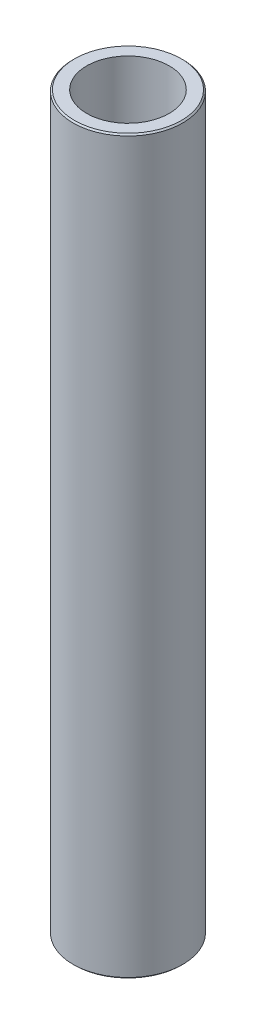
ISO-10303-21;
HEADER;
FILE_DESCRIPTION(('STEP AP214'),'2;1');
FILE_NAME('part.step','',(''),(''),'','','');
FILE_SCHEMA(('AUTOMOTIVE_DESIGN { 1 0 10303 214 1 1 1 1 }'));
ENDSEC;
DATA;
#1=APPLICATION_CONTEXT('core data for automotive mechanical design processes');
#2=APPLICATION_PROTOCOL_DEFINITION('international standard','automotive_design',2000,#1);
#3=PRODUCT_CONTEXT('',#1,'mechanical');
#4=PRODUCT('Part','Part','',(#3));
#5=PRODUCT_RELATED_PRODUCT_CATEGORY('part','',(#4));
#6=PRODUCT_DEFINITION_FORMATION('','',#4);
#7=PRODUCT_DEFINITION_CONTEXT('part definition',#1,'design');
#8=PRODUCT_DEFINITION('design','',#6,#7);
#9=PRODUCT_DEFINITION_SHAPE('','',#8);
#10=(LENGTH_UNIT() NAMED_UNIT(*) SI_UNIT(.MILLI.,.METRE.));
#11=(NAMED_UNIT(*) PLANE_ANGLE_UNIT() SI_UNIT($,.RADIAN.));
#12=(NAMED_UNIT(*) SI_UNIT($,.STERADIAN.) SOLID_ANGLE_UNIT());
#13=UNCERTAINTY_MEASURE_WITH_UNIT(LENGTH_MEASURE(1.E-05),#10,'distance_accuracy_value','');
#14=(GEOMETRIC_REPRESENTATION_CONTEXT(3) GLOBAL_UNCERTAINTY_ASSIGNED_CONTEXT((#13)) GLOBAL_UNIT_ASSIGNED_CONTEXT((#10,
#11,#12)) REPRESENTATION_CONTEXT('',''));
#15=CARTESIAN_POINT('',(0.,0.,0.));
#16=DIRECTION('',(0.,0.,1.));
#17=DIRECTION('',(1.,0.,0.));
#18=AXIS2_PLACEMENT_3D('',#15,#16,#17);
#19=CARTESIAN_POINT('',(0.,600.,0.));
#20=DIRECTION('',(0.,-1.,0.));
#21=DIRECTION('',(0.,0.,-1.));
#22=AXIS2_PLACEMENT_3D('',#19,#20,#21);
#23=CYLINDRICAL_SURFACE('',#22,45.);
#24=CARTESIAN_POINT('',(0.,598.83356213595,0.));
#25=DIRECTION('',(0.,1.,0.));
#26=DIRECTION('',(0.,0.,1.));
#27=AXIS2_PLACEMENT_3D('',#24,#25,#26);
#28=CIRCLE('',#27,45.);
#29=CARTESIAN_POINT('',(0.,598.83356213595,45.));
#30=VERTEX_POINT('',#29);
#31=EDGE_CURVE('E50',#30,#30,#28,.F.);
#32=ORIENTED_EDGE('',*,*,#31,.T.);
#33=EDGE_LOOP('',(#32));
#34=FACE_BOUND('',#33,.T.);
#35=CARTESIAN_POINT('',(0.,1.16643786405046,0.));
#36=DIRECTION('',(0.,1.,0.));
#37=DIRECTION('',(0.,0.,1.));
#38=AXIS2_PLACEMENT_3D('',#35,#36,#37);
#39=CIRCLE('',#38,45.);
#40=CARTESIAN_POINT('',(0.,1.16643786405046,45.));
#41=VERTEX_POINT('',#40);
#42=EDGE_CURVE('E51',#41,#41,#39,.T.);
#43=ORIENTED_EDGE('',*,*,#42,.T.);
#44=EDGE_LOOP('',(#43));
#45=FACE_BOUND('',#44,.T.);
#46=ADVANCED_FACE('F39',(#34,#45),#23,.T.);
#47=CARTESIAN_POINT('',(0.,600.,0.));
#48=DIRECTION('',(0.,1.,0.));
#49=DIRECTION('',(0.,0.,1.));
#50=AXIS2_PLACEMENT_3D('',#47,#48,#49);
#51=PLANE('',#50);
#52=CARTESIAN_POINT('',(0.,600.,0.));
#53=DIRECTION('',(0.,1.,0.));
#54=DIRECTION('',(0.,0.,1.));
#55=AXIS2_PLACEMENT_3D('',#52,#53,#54);
#56=CIRCLE('',#55,43.8335621359499);
#57=CARTESIAN_POINT('',(0.,600.,43.8335621359499));
#58=VERTEX_POINT('',#57);
#59=EDGE_CURVE('E54',#58,#58,#56,.T.);
#60=ORIENTED_EDGE('',*,*,#59,.T.);
#61=EDGE_LOOP('',(#60));
#62=FACE_BOUND('',#61,.T.);
#63=CARTESIAN_POINT('',(0.,600.,0.));
#64=DIRECTION('',(0.,1.,0.));
#65=DIRECTION('',(0.,0.,1.));
#66=AXIS2_PLACEMENT_3D('',#63,#64,#65);
#67=CIRCLE('',#66,33.8355951855669);
#68=CARTESIAN_POINT('',(0.,600.,33.8355951855669));
#69=VERTEX_POINT('',#68);
#70=EDGE_CURVE('E58',#69,#69,#67,.T.);
#71=ORIENTED_EDGE('',*,*,#70,.F.);
#72=EDGE_LOOP('',(#71));
#73=FACE_BOUND('',#72,.T.);
#74=ADVANCED_FACE('F69',(#62,#73),#51,.T.);
#75=CARTESIAN_POINT('',(0.,0.,0.));
#76=DIRECTION('',(0.,1.,0.));
#77=DIRECTION('',(0.,0.,1.));
#78=AXIS2_PLACEMENT_3D('',#75,#76,#77);
#79=PLANE('',#78);
#80=CARTESIAN_POINT('',(0.,0.,0.));
#81=DIRECTION('',(0.,1.,0.));
#82=DIRECTION('',(0.,0.,1.));
#83=AXIS2_PLACEMENT_3D('',#80,#81,#82);
#84=CIRCLE('',#83,43.8335621359496);
#85=CARTESIAN_POINT('',(0.,0.,43.8335621359496));
#86=VERTEX_POINT('',#85);
#87=EDGE_CURVE('E10',#86,#86,#84,.F.);
#88=ORIENTED_EDGE('',*,*,#87,.T.);
#89=EDGE_LOOP('',(#88));
#90=FACE_BOUND('',#89,.T.);
#91=CARTESIAN_POINT('',(0.,0.,0.));
#92=DIRECTION('',(0.,1.,0.));
#93=DIRECTION('',(0.,0.,1.));
#94=AXIS2_PLACEMENT_3D('',#91,#92,#93);
#95=CIRCLE('',#94,33.8355951855669);
#96=CARTESIAN_POINT('',(0.,0.,33.8355951855669));
#97=VERTEX_POINT('',#96);
#98=EDGE_CURVE('E63',#97,#97,#95,.T.);
#99=ORIENTED_EDGE('',*,*,#98,.T.);
#100=EDGE_LOOP('',(#99));
#101=FACE_BOUND('',#100,.T.);
#102=ADVANCED_FACE('F75',(#90,#101),#79,.F.);
#103=CARTESIAN_POINT('',(0.,600.,0.));
#104=DIRECTION('',(0.,-1.,0.));
#105=DIRECTION('',(0.,0.,-1.));
#106=AXIS2_PLACEMENT_3D('',#103,#104,#105);
#107=CYLINDRICAL_SURFACE('',#106,33.8355951855669);
#108=ORIENTED_EDGE('',*,*,#70,.T.);
#109=EDGE_LOOP('',(#108));
#110=FACE_BOUND('',#109,.T.);
#111=ORIENTED_EDGE('',*,*,#98,.F.);
#112=EDGE_LOOP('',(#111));
#113=FACE_BOUND('',#112,.T.);
#114=ADVANCED_FACE('F70',(#110,#113),#107,.F.);
#115=CARTESIAN_POINT('',(0.,600.,0.));
#116=DIRECTION('',(0.,-1.,0.));
#117=DIRECTION('',(0.,0.,-1.));
#118=AXIS2_PLACEMENT_3D('',#115,#116,#117);
#119=CONICAL_SURFACE('',#118,43.8335621359499,0.785398163397389);
#120=ORIENTED_EDGE('',*,*,#31,.F.);
#121=EDGE_LOOP('',(#120));
#122=FACE_BOUND('',#121,.T.);
#123=ORIENTED_EDGE('',*,*,#59,.F.);
#124=EDGE_LOOP('',(#123));
#125=FACE_BOUND('',#124,.T.);
#126=ADVANCED_FACE('F81',(#122,#125),#119,.T.);
#127=CARTESIAN_POINT('',(0.,1.16643786405046,0.));
#128=DIRECTION('',(0.,1.,0.));
#129=DIRECTION('',(0.,0.,1.));
#130=AXIS2_PLACEMENT_3D('',#127,#128,#129);
#131=CONICAL_SURFACE('',#130,45.,0.785398163397437);
#132=ORIENTED_EDGE('',*,*,#87,.F.);
#133=EDGE_LOOP('',(#132));
#134=FACE_BOUND('',#133,.T.);
#135=ORIENTED_EDGE('',*,*,#42,.F.);
#136=EDGE_LOOP('',(#135));
#137=FACE_BOUND('',#136,.T.);
#138=ADVANCED_FACE('F45',(#134,#137),#131,.T.);
#139=CLOSED_SHELL('',(#46,#74,#102,#114,#126,#138));
#140=MANIFOLD_SOLID_BREP('B2',#139);
#141=ADVANCED_BREP_SHAPE_REPRESENTATION('',(#18,#140),#14);
#142=SHAPE_DEFINITION_REPRESENTATION(#9,#141);
ENDSEC;
END-ISO-10303-21;
